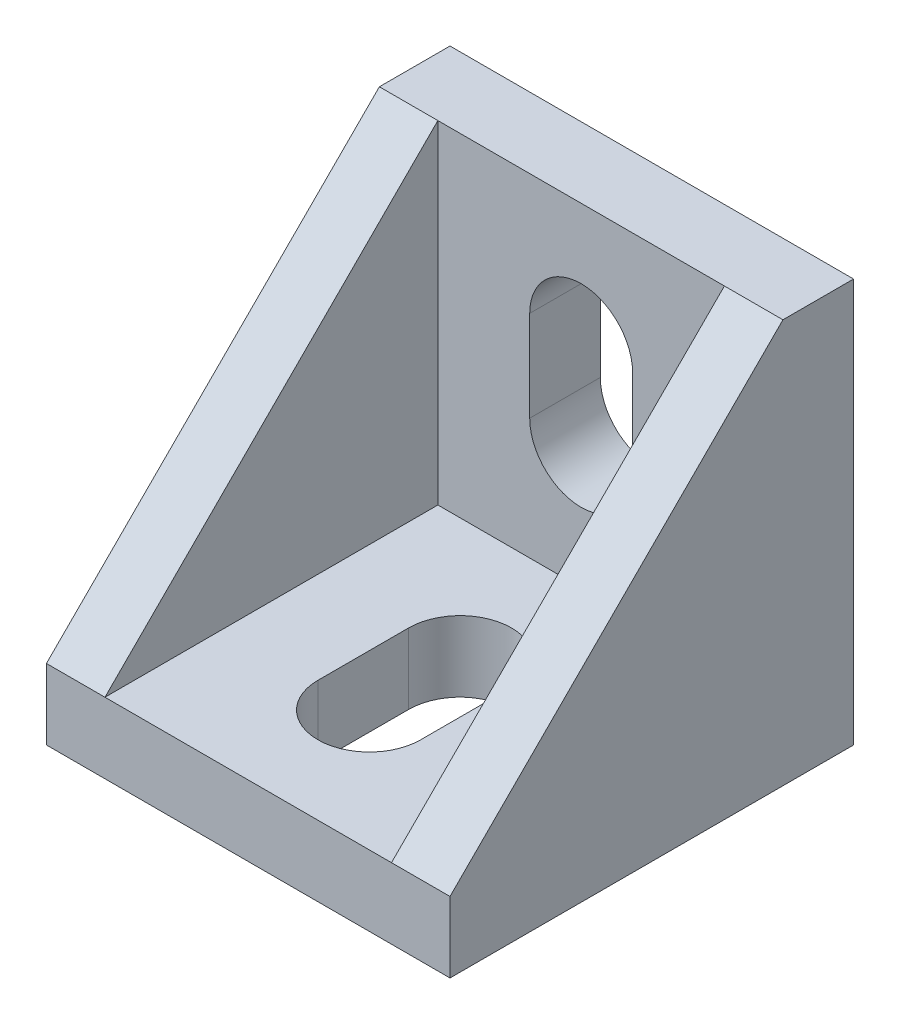
ISO-10303-21;
HEADER;
FILE_DESCRIPTION(('STEP AP214'),'2;1');
FILE_NAME('part.step','',(''),(''),'','','');
FILE_SCHEMA(('AUTOMOTIVE_DESIGN { 1 0 10303 214 1 1 1 1 }'));
ENDSEC;
DATA;
#1=APPLICATION_CONTEXT('core data for automotive mechanical design processes');
#2=APPLICATION_PROTOCOL_DEFINITION('international standard','automotive_design',2000,#1);
#3=PRODUCT_CONTEXT('',#1,'mechanical');
#4=PRODUCT('Part','Part','',(#3));
#5=PRODUCT_RELATED_PRODUCT_CATEGORY('part','',(#4));
#6=PRODUCT_DEFINITION_FORMATION('','',#4);
#7=PRODUCT_DEFINITION_CONTEXT('part definition',#1,'design');
#8=PRODUCT_DEFINITION('design','',#6,#7);
#9=PRODUCT_DEFINITION_SHAPE('','',#8);
#10=(LENGTH_UNIT() NAMED_UNIT(*) SI_UNIT(.MILLI.,.METRE.));
#11=(NAMED_UNIT(*) PLANE_ANGLE_UNIT() SI_UNIT($,.RADIAN.));
#12=(NAMED_UNIT(*) SI_UNIT($,.STERADIAN.) SOLID_ANGLE_UNIT());
#13=UNCERTAINTY_MEASURE_WITH_UNIT(LENGTH_MEASURE(1.E-05),#10,'distance_accuracy_value','');
#14=(GEOMETRIC_REPRESENTATION_CONTEXT(3) GLOBAL_UNCERTAINTY_ASSIGNED_CONTEXT((#13)) GLOBAL_UNIT_ASSIGNED_CONTEXT((#10,
#11,#12)) REPRESENTATION_CONTEXT('',''));
#15=CARTESIAN_POINT('',(0.,0.,0.));
#16=DIRECTION('',(0.,0.,1.));
#17=DIRECTION('',(1.,0.,0.));
#18=AXIS2_PLACEMENT_3D('',#15,#16,#17);
#19=CARTESIAN_POINT('',(0.,20.,3.5));
#20=DIRECTION('',(0.,0.,-1.));
#21=DIRECTION('',(-1.,0.,0.));
#22=AXIS2_PLACEMENT_3D('',#19,#20,#21);
#23=PLANE('',#22);
#24=DIRECTION('',(0.,-1.,0.));
#25=VECTOR('',#24,1.);
#26=CARTESIAN_POINT('',(7.45,9.5,3.5));
#27=LINE('',#26,#25);
#28=CARTESIAN_POINT('',(7.45,14.,3.5));
#29=VERTEX_POINT('',#28);
#30=CARTESIAN_POINT('',(7.45,9.5,3.5));
#31=VERTEX_POINT('',#30);
#32=EDGE_CURVE('E166',#29,#31,#27,.T.);
#33=ORIENTED_EDGE('',*,*,#32,.F.);
#34=CARTESIAN_POINT('',(10.,14.,3.5));
#35=DIRECTION('',(0.,0.,1.));
#36=DIRECTION('',(1.,0.,0.));
#37=AXIS2_PLACEMENT_3D('',#34,#35,#36);
#38=CIRCLE('',#37,2.55);
#39=CARTESIAN_POINT('',(12.55,14.,3.5));
#40=VERTEX_POINT('',#39);
#41=EDGE_CURVE('E49',#40,#29,#38,.T.);
#42=ORIENTED_EDGE('',*,*,#41,.F.);
#43=DIRECTION('',(0.,1.,0.));
#44=VECTOR('',#43,1.);
#45=CARTESIAN_POINT('',(12.55,14.,3.5));
#46=LINE('',#45,#44);
#47=CARTESIAN_POINT('',(12.55,9.5,3.5));
#48=VERTEX_POINT('',#47);
#49=EDGE_CURVE('E159',#48,#40,#46,.T.);
#50=ORIENTED_EDGE('',*,*,#49,.F.);
#51=CARTESIAN_POINT('',(10.,9.5,3.5));
#52=DIRECTION('',(0.,0.,1.));
#53=DIRECTION('',(-1.,0.,0.));
#54=AXIS2_PLACEMENT_3D('',#51,#52,#53);
#55=CIRCLE('',#54,2.55);
#56=EDGE_CURVE('E173',#31,#48,#55,.T.);
#57=ORIENTED_EDGE('',*,*,#56,.F.);
#58=EDGE_LOOP('',(#33,#42,#50,#57));
#59=FACE_BOUND('',#58,.T.);
#60=DIRECTION('',(0.,-1.,0.));
#61=VECTOR('',#60,1.);
#62=CARTESIAN_POINT('',(2.9,3.5,3.5));
#63=LINE('',#62,#61);
#64=CARTESIAN_POINT('',(2.9,20.,3.5));
#65=VERTEX_POINT('',#64);
#66=CARTESIAN_POINT('',(2.9,3.5,3.5));
#67=VERTEX_POINT('',#66);
#68=EDGE_CURVE('E213',#65,#67,#63,.T.);
#69=ORIENTED_EDGE('',*,*,#68,.T.);
#70=DIRECTION('',(-1.,0.,0.));
#71=VECTOR('',#70,1.);
#72=CARTESIAN_POINT('',(0.,3.5,3.5));
#73=LINE('',#72,#71);
#74=CARTESIAN_POINT('',(17.1,3.5,3.5));
#75=VERTEX_POINT('',#74);
#76=EDGE_CURVE('E36',#75,#67,#73,.T.);
#77=ORIENTED_EDGE('',*,*,#76,.F.);
#78=DIRECTION('',(0.,1.,0.));
#79=VECTOR('',#78,1.);
#80=CARTESIAN_POINT('',(17.1,3.5,3.5));
#81=LINE('',#80,#79);
#82=CARTESIAN_POINT('',(17.1,20.,3.5));
#83=VERTEX_POINT('',#82);
#84=EDGE_CURVE('E230',#75,#83,#81,.T.);
#85=ORIENTED_EDGE('',*,*,#84,.T.);
#86=DIRECTION('',(-1.,0.,0.));
#87=VECTOR('',#86,1.);
#88=CARTESIAN_POINT('',(0.,20.,3.5));
#89=LINE('',#88,#87);
#90=EDGE_CURVE('E259',#83,#65,#89,.T.);
#91=ORIENTED_EDGE('',*,*,#90,.T.);
#92=EDGE_LOOP('',(#69,#77,#85,#91));
#93=FACE_BOUND('',#92,.T.);
#94=ADVANCED_FACE('F32',(#59,#93),#23,.F.);
#95=CARTESIAN_POINT('',(0.,3.5,20.));
#96=DIRECTION('',(0.,-1.,0.));
#97=DIRECTION('',(0.,0.,-1.));
#98=AXIS2_PLACEMENT_3D('',#95,#96,#97);
#99=PLANE('',#98);
#100=DIRECTION('',(0.,0.,-1.));
#101=VECTOR('',#100,1.);
#102=CARTESIAN_POINT('',(12.55,3.5,9.5));
#103=LINE('',#102,#101);
#104=CARTESIAN_POINT('',(12.55,3.5,14.));
#105=VERTEX_POINT('',#104);
#106=CARTESIAN_POINT('',(12.55,3.5,9.5));
#107=VERTEX_POINT('',#106);
#108=EDGE_CURVE('E191',#105,#107,#103,.T.);
#109=ORIENTED_EDGE('',*,*,#108,.F.);
#110=CARTESIAN_POINT('',(10.,3.5,14.));
#111=DIRECTION('',(0.,1.,0.));
#112=DIRECTION('',(0.,0.,1.));
#113=AXIS2_PLACEMENT_3D('',#110,#111,#112);
#114=CIRCLE('',#113,2.55);
#115=CARTESIAN_POINT('',(7.45,3.5,14.));
#116=VERTEX_POINT('',#115);
#117=EDGE_CURVE('E189',#116,#105,#114,.T.);
#118=ORIENTED_EDGE('',*,*,#117,.F.);
#119=DIRECTION('',(0.,0.,1.));
#120=VECTOR('',#119,1.);
#121=CARTESIAN_POINT('',(7.45,3.5,14.));
#122=LINE('',#121,#120);
#123=CARTESIAN_POINT('',(7.45,3.5,9.5));
#124=VERTEX_POINT('',#123);
#125=EDGE_CURVE('E197',#124,#116,#122,.T.);
#126=ORIENTED_EDGE('',*,*,#125,.F.);
#127=CARTESIAN_POINT('',(10.,3.5,9.5));
#128=DIRECTION('',(0.,1.,0.));
#129=DIRECTION('',(0.,0.,-1.));
#130=AXIS2_PLACEMENT_3D('',#127,#128,#129);
#131=CIRCLE('',#130,2.55);
#132=EDGE_CURVE('E194',#107,#124,#131,.T.);
#133=ORIENTED_EDGE('',*,*,#132,.F.);
#134=EDGE_LOOP('',(#109,#118,#126,#133));
#135=FACE_BOUND('',#134,.T.);
#136=DIRECTION('',(0.,0.,1.));
#137=VECTOR('',#136,1.);
#138=CARTESIAN_POINT('',(2.9,3.5,20.));
#139=LINE('',#138,#137);
#140=CARTESIAN_POINT('',(2.9,3.5,20.));
#141=VERTEX_POINT('',#140);
#142=EDGE_CURVE('E216',#67,#141,#139,.T.);
#143=ORIENTED_EDGE('',*,*,#142,.T.);
#144=DIRECTION('',(-1.,0.,0.));
#145=VECTOR('',#144,1.);
#146=CARTESIAN_POINT('',(0.,3.5,20.));
#147=LINE('',#146,#145);
#148=CARTESIAN_POINT('',(17.1,3.5,20.));
#149=VERTEX_POINT('',#148);
#150=EDGE_CURVE('E250',#149,#141,#147,.T.);
#151=ORIENTED_EDGE('',*,*,#150,.F.);
#152=DIRECTION('',(0.,0.,-1.));
#153=VECTOR('',#152,1.);
#154=CARTESIAN_POINT('',(17.1,3.5,20.));
#155=LINE('',#154,#153);
#156=EDGE_CURVE('E236',#149,#75,#155,.T.);
#157=ORIENTED_EDGE('',*,*,#156,.T.);
#158=ORIENTED_EDGE('',*,*,#76,.T.);
#159=EDGE_LOOP('',(#143,#151,#157,#158));
#160=FACE_BOUND('',#159,.T.);
#161=ADVANCED_FACE('F298',(#135,#160),#99,.F.);
#162=CARTESIAN_POINT('',(0.,0.,3.5));
#163=DIRECTION('',(1.,0.,0.));
#164=DIRECTION('',(0.,0.,-1.));
#165=AXIS2_PLACEMENT_3D('',#162,#163,#164);
#166=PLANE('',#165);
#167=DIRECTION('',(0.,-1.,0.));
#168=VECTOR('',#167,1.);
#169=CARTESIAN_POINT('',(0.,0.,0.));
#170=LINE('',#169,#168);
#171=CARTESIAN_POINT('',(0.,20.,0.));
#172=VERTEX_POINT('',#171);
#173=CARTESIAN_POINT('',(0.,0.,0.));
#174=VERTEX_POINT('',#173);
#175=EDGE_CURVE('E253',#172,#174,#170,.T.);
#176=ORIENTED_EDGE('',*,*,#175,.T.);
#177=DIRECTION('',(0.,0.,-1.));
#178=VECTOR('',#177,1.);
#179=CARTESIAN_POINT('',(0.,0.,3.5));
#180=LINE('',#179,#178);
#181=CARTESIAN_POINT('',(0.,0.,20.));
#182=VERTEX_POINT('',#181);
#183=EDGE_CURVE('E11',#182,#174,#180,.T.);
#184=ORIENTED_EDGE('',*,*,#183,.F.);
#185=DIRECTION('',(0.,-1.,0.));
#186=VECTOR('',#185,1.);
#187=CARTESIAN_POINT('',(0.,0.,20.));
#188=LINE('',#187,#186);
#189=CARTESIAN_POINT('',(0.,3.5,20.));
#190=VERTEX_POINT('',#189);
#191=EDGE_CURVE('E241',#190,#182,#188,.T.);
#192=ORIENTED_EDGE('',*,*,#191,.F.);
#193=DIRECTION('',(0.,0.707106781186547,-0.707106781186547));
#194=VECTOR('',#193,1.);
#195=CARTESIAN_POINT('',(0.,20.,3.5));
#196=LINE('',#195,#194);
#197=CARTESIAN_POINT('',(0.,20.,3.5));
#198=VERTEX_POINT('',#197);
#199=EDGE_CURVE('E212',#190,#198,#196,.T.);
#200=ORIENTED_EDGE('',*,*,#199,.T.);
#201=DIRECTION('',(0.,0.,-1.));
#202=VECTOR('',#201,1.);
#203=CARTESIAN_POINT('',(0.,20.,3.5));
#204=LINE('',#203,#202);
#205=EDGE_CURVE('E258',#198,#172,#204,.T.);
#206=ORIENTED_EDGE('',*,*,#205,.T.);
#207=EDGE_LOOP('',(#176,#184,#192,#200,#206));
#208=FACE_BOUND('',#207,.T.);
#209=ADVANCED_FACE('F34',(#208),#166,.F.);
#210=CARTESIAN_POINT('',(0.,0.,3.5));
#211=DIRECTION('',(0.,1.,0.));
#212=DIRECTION('',(0.,0.,1.));
#213=AXIS2_PLACEMENT_3D('',#210,#211,#212);
#214=PLANE('',#213);
#215=DIRECTION('',(0.,0.,-1.));
#216=VECTOR('',#215,1.);
#217=CARTESIAN_POINT('',(7.45,0.,14.));
#218=LINE('',#217,#216);
#219=CARTESIAN_POINT('',(7.45,0.,14.));
#220=VERTEX_POINT('',#219);
#221=CARTESIAN_POINT('',(7.45,0.,9.5));
#222=VERTEX_POINT('',#221);
#223=EDGE_CURVE('E183',#220,#222,#218,.T.);
#224=ORIENTED_EDGE('',*,*,#223,.F.);
#225=CARTESIAN_POINT('',(10.,0.,14.));
#226=DIRECTION('',(0.,1.,0.));
#227=DIRECTION('',(0.,0.,1.));
#228=AXIS2_PLACEMENT_3D('',#225,#226,#227);
#229=CIRCLE('',#228,2.55);
#230=CARTESIAN_POINT('',(12.55,0.,14.));
#231=VERTEX_POINT('',#230);
#232=EDGE_CURVE('E186',#231,#220,#229,.F.);
#233=ORIENTED_EDGE('',*,*,#232,.F.);
#234=DIRECTION('',(0.,0.,1.));
#235=VECTOR('',#234,1.);
#236=CARTESIAN_POINT('',(12.55,0.,9.5));
#237=LINE('',#236,#235);
#238=CARTESIAN_POINT('',(12.55,0.,9.5));
#239=VERTEX_POINT('',#238);
#240=EDGE_CURVE('E203',#239,#231,#237,.T.);
#241=ORIENTED_EDGE('',*,*,#240,.F.);
#242=CARTESIAN_POINT('',(10.,0.,9.5));
#243=DIRECTION('',(0.,1.,0.));
#244=DIRECTION('',(0.,0.,1.));
#245=AXIS2_PLACEMENT_3D('',#242,#243,#244);
#246=CIRCLE('',#245,2.55);
#247=EDGE_CURVE('E153',#222,#239,#246,.F.);
#248=ORIENTED_EDGE('',*,*,#247,.F.);
#249=EDGE_LOOP('',(#224,#233,#241,#248));
#250=FACE_BOUND('',#249,.T.);
#251=DIRECTION('',(1.,0.,0.));
#252=VECTOR('',#251,1.);
#253=CARTESIAN_POINT('',(0.,0.,0.));
#254=LINE('',#253,#252);
#255=CARTESIAN_POINT('',(20.,0.,0.));
#256=VERTEX_POINT('',#255);
#257=EDGE_CURVE('E262',#174,#256,#254,.T.);
#258=ORIENTED_EDGE('',*,*,#257,.T.);
#259=DIRECTION('',(0.,0.,-1.));
#260=VECTOR('',#259,1.);
#261=CARTESIAN_POINT('',(20.,0.,3.5));
#262=LINE('',#261,#260);
#263=CARTESIAN_POINT('',(20.,0.,20.));
#264=VERTEX_POINT('',#263);
#265=EDGE_CURVE('E42',#264,#256,#262,.T.);
#266=ORIENTED_EDGE('',*,*,#265,.F.);
#267=DIRECTION('',(1.,0.,0.));
#268=VECTOR('',#267,1.);
#269=CARTESIAN_POINT('',(0.,0.,20.));
#270=LINE('',#269,#268);
#271=EDGE_CURVE('E244',#182,#264,#270,.T.);
#272=ORIENTED_EDGE('',*,*,#271,.F.);
#273=ORIENTED_EDGE('',*,*,#183,.T.);
#274=EDGE_LOOP('',(#258,#266,#272,#273));
#275=FACE_BOUND('',#274,.T.);
#276=ADVANCED_FACE('F334',(#250,#275),#214,.F.);
#277=CARTESIAN_POINT('',(20.,0.,3.5));
#278=DIRECTION('',(-1.,0.,0.));
#279=DIRECTION('',(0.,0.,1.));
#280=AXIS2_PLACEMENT_3D('',#277,#278,#279);
#281=PLANE('',#280);
#282=DIRECTION('',(0.,0.,-1.));
#283=VECTOR('',#282,1.);
#284=CARTESIAN_POINT('',(20.,20.,3.5));
#285=LINE('',#284,#283);
#286=CARTESIAN_POINT('',(20.,20.,3.5));
#287=VERTEX_POINT('',#286);
#288=CARTESIAN_POINT('',(20.,20.,0.));
#289=VERTEX_POINT('',#288);
#290=EDGE_CURVE('E270',#287,#289,#285,.T.);
#291=ORIENTED_EDGE('',*,*,#290,.F.);
#292=DIRECTION('',(0.,-0.707106781186547,0.707106781186547));
#293=VECTOR('',#292,1.);
#294=CARTESIAN_POINT('',(20.,20.,3.5));
#295=LINE('',#294,#293);
#296=CARTESIAN_POINT('',(20.,3.5,20.));
#297=VERTEX_POINT('',#296);
#298=EDGE_CURVE('E227',#287,#297,#295,.T.);
#299=ORIENTED_EDGE('',*,*,#298,.T.);
#300=DIRECTION('',(0.,1.,0.));
#301=VECTOR('',#300,1.);
#302=CARTESIAN_POINT('',(20.,0.,20.));
#303=LINE('',#302,#301);
#304=EDGE_CURVE('E247',#264,#297,#303,.T.);
#305=ORIENTED_EDGE('',*,*,#304,.F.);
#306=ORIENTED_EDGE('',*,*,#265,.T.);
#307=DIRECTION('',(0.,1.,0.));
#308=VECTOR('',#307,1.);
#309=CARTESIAN_POINT('',(20.,0.,0.));
#310=LINE('',#309,#308);
#311=EDGE_CURVE('E264',#256,#289,#310,.T.);
#312=ORIENTED_EDGE('',*,*,#311,.T.);
#313=EDGE_LOOP('',(#291,#299,#305,#306,#312));
#314=FACE_BOUND('',#313,.T.);
#315=ADVANCED_FACE('F278',(#314),#281,.F.);
#316=CARTESIAN_POINT('',(0.,20.,3.5));
#317=DIRECTION('',(0.,-1.,0.));
#318=DIRECTION('',(0.,0.,-1.));
#319=AXIS2_PLACEMENT_3D('',#316,#317,#318);
#320=PLANE('',#319);
#321=DIRECTION('',(-1.,0.,0.));
#322=VECTOR('',#321,1.);
#323=CARTESIAN_POINT('',(0.,20.,0.));
#324=LINE('',#323,#322);
#325=EDGE_CURVE('E266',#289,#172,#324,.T.);
#326=ORIENTED_EDGE('',*,*,#325,.T.);
#327=ORIENTED_EDGE('',*,*,#205,.F.);
#328=DIRECTION('',(-1.,0.,0.));
#329=VECTOR('',#328,1.);
#330=CARTESIAN_POINT('',(2.9,20.,3.5));
#331=LINE('',#330,#329);
#332=EDGE_CURVE('E225',#65,#198,#331,.T.);
#333=ORIENTED_EDGE('',*,*,#332,.F.);
#334=ORIENTED_EDGE('',*,*,#90,.F.);
#335=EDGE_CURVE('E256',#287,#83,#89,.T.);
#336=ORIENTED_EDGE('',*,*,#335,.F.);
#337=ORIENTED_EDGE('',*,*,#290,.T.);
#338=EDGE_LOOP('',(#326,#327,#333,#334,#336,#337));
#339=FACE_BOUND('',#338,.T.);
#340=ADVANCED_FACE('F285',(#339),#320,.F.);
#341=CARTESIAN_POINT('',(0.,20.,0.));
#342=DIRECTION('',(0.,0.,-1.));
#343=DIRECTION('',(-1.,0.,0.));
#344=AXIS2_PLACEMENT_3D('',#341,#342,#343);
#345=PLANE('',#344);
#346=CARTESIAN_POINT('',(10.,14.,0.));
#347=DIRECTION('',(0.,0.,-1.));
#348=DIRECTION('',(-1.,0.,0.));
#349=AXIS2_PLACEMENT_3D('',#346,#347,#348);
#350=CIRCLE('',#349,2.55);
#351=CARTESIAN_POINT('',(12.55,14.,0.));
#352=VERTEX_POINT('',#351);
#353=CARTESIAN_POINT('',(7.45,14.,0.));
#354=VERTEX_POINT('',#353);
#355=EDGE_CURVE('E157',#352,#354,#350,.F.);
#356=ORIENTED_EDGE('',*,*,#355,.T.);
#357=DIRECTION('',(0.,-1.,0.));
#358=VECTOR('',#357,1.);
#359=CARTESIAN_POINT('',(7.45,9.5,0.));
#360=LINE('',#359,#358);
#361=CARTESIAN_POINT('',(7.45,9.5,0.));
#362=VERTEX_POINT('',#361);
#363=EDGE_CURVE('E146',#354,#362,#360,.T.);
#364=ORIENTED_EDGE('',*,*,#363,.T.);
#365=CARTESIAN_POINT('',(10.,9.5,0.));
#366=DIRECTION('',(0.,0.,-1.));
#367=DIRECTION('',(-1.,0.,0.));
#368=AXIS2_PLACEMENT_3D('',#365,#366,#367);
#369=CIRCLE('',#368,2.55);
#370=CARTESIAN_POINT('',(12.55,9.5,0.));
#371=VERTEX_POINT('',#370);
#372=EDGE_CURVE('E168',#362,#371,#369,.F.);
#373=ORIENTED_EDGE('',*,*,#372,.T.);
#374=DIRECTION('',(0.,1.,0.));
#375=VECTOR('',#374,1.);
#376=CARTESIAN_POINT('',(12.55,14.,0.));
#377=LINE('',#376,#375);
#378=EDGE_CURVE('E164',#371,#352,#377,.T.);
#379=ORIENTED_EDGE('',*,*,#378,.T.);
#380=EDGE_LOOP('',(#356,#364,#373,#379));
#381=FACE_BOUND('',#380,.T.);
#382=ORIENTED_EDGE('',*,*,#175,.F.);
#383=ORIENTED_EDGE('',*,*,#325,.F.);
#384=ORIENTED_EDGE('',*,*,#311,.F.);
#385=ORIENTED_EDGE('',*,*,#257,.F.);
#386=EDGE_LOOP('',(#382,#383,#384,#385));
#387=FACE_BOUND('',#386,.T.);
#388=ADVANCED_FACE('F162',(#381,#387),#345,.T.);
#389=CARTESIAN_POINT('',(0.,3.5,20.));
#390=DIRECTION('',(0.,0.,-1.));
#391=DIRECTION('',(-1.,0.,0.));
#392=AXIS2_PLACEMENT_3D('',#389,#390,#391);
#393=PLANE('',#392);
#394=ORIENTED_EDGE('',*,*,#191,.T.);
#395=ORIENTED_EDGE('',*,*,#271,.T.);
#396=ORIENTED_EDGE('',*,*,#304,.T.);
#397=EDGE_CURVE('E251',#297,#149,#147,.T.);
#398=ORIENTED_EDGE('',*,*,#397,.T.);
#399=ORIENTED_EDGE('',*,*,#150,.T.);
#400=DIRECTION('',(-1.,0.,0.));
#401=VECTOR('',#400,1.);
#402=CARTESIAN_POINT('',(2.9,3.5,20.));
#403=LINE('',#402,#401);
#404=EDGE_CURVE('E222',#141,#190,#403,.T.);
#405=ORIENTED_EDGE('',*,*,#404,.T.);
#406=EDGE_LOOP('',(#394,#395,#396,#398,#399,#405));
#407=FACE_BOUND('',#406,.T.);
#408=ADVANCED_FACE('F295',(#407),#393,.F.);
#409=CARTESIAN_POINT('',(17.1,20.,3.5));
#410=DIRECTION('',(0.,0.707106781186548,0.707106781186548));
#411=DIRECTION('',(0.,-0.707106781186548,0.707106781186548));
#412=AXIS2_PLACEMENT_3D('',#409,#410,#411);
#413=PLANE('',#412);
#414=ORIENTED_EDGE('',*,*,#298,.F.);
#415=ORIENTED_EDGE('',*,*,#335,.T.);
#416=DIRECTION('',(0.,-0.707106781186547,0.707106781186547));
#417=VECTOR('',#416,1.);
#418=CARTESIAN_POINT('',(17.1,20.,3.5));
#419=LINE('',#418,#417);
#420=EDGE_CURVE('E233',#83,#149,#419,.T.);
#421=ORIENTED_EDGE('',*,*,#420,.T.);
#422=ORIENTED_EDGE('',*,*,#397,.F.);
#423=EDGE_LOOP('',(#414,#415,#421,#422));
#424=FACE_BOUND('',#423,.T.);
#425=ADVANCED_FACE('F308',(#424),#413,.T.);
#426=CARTESIAN_POINT('',(17.1,3.5,3.5));
#427=DIRECTION('',(-1.,0.,0.));
#428=DIRECTION('',(0.,0.,1.));
#429=AXIS2_PLACEMENT_3D('',#426,#427,#428);
#430=PLANE('',#429);
#431=ORIENTED_EDGE('',*,*,#84,.F.);
#432=ORIENTED_EDGE('',*,*,#156,.F.);
#433=ORIENTED_EDGE('',*,*,#420,.F.);
#434=EDGE_LOOP('',(#431,#432,#433));
#435=FACE_BOUND('',#434,.T.);
#436=ADVANCED_FACE('F310',(#435),#430,.T.);
#437=CARTESIAN_POINT('',(2.9,20.,3.5));
#438=DIRECTION('',(0.,0.707106781186548,0.707106781186548));
#439=DIRECTION('',(0.,-0.707106781186548,0.707106781186548));
#440=AXIS2_PLACEMENT_3D('',#437,#438,#439);
#441=PLANE('',#440);
#442=ORIENTED_EDGE('',*,*,#199,.F.);
#443=ORIENTED_EDGE('',*,*,#404,.F.);
#444=DIRECTION('',(0.,0.707106781186547,-0.707106781186547));
#445=VECTOR('',#444,1.);
#446=CARTESIAN_POINT('',(2.9,20.,3.5));
#447=LINE('',#446,#445);
#448=EDGE_CURVE('E219',#141,#65,#447,.T.);
#449=ORIENTED_EDGE('',*,*,#448,.T.);
#450=ORIENTED_EDGE('',*,*,#332,.T.);
#451=EDGE_LOOP('',(#442,#443,#449,#450));
#452=FACE_BOUND('',#451,.T.);
#453=ADVANCED_FACE('F291',(#452),#441,.T.);
#454=CARTESIAN_POINT('',(2.9,3.5,3.5));
#455=DIRECTION('',(-1.,0.,0.));
#456=DIRECTION('',(0.,0.,1.));
#457=AXIS2_PLACEMENT_3D('',#454,#455,#456);
#458=PLANE('',#457);
#459=ORIENTED_EDGE('',*,*,#68,.F.);
#460=ORIENTED_EDGE('',*,*,#448,.F.);
#461=ORIENTED_EDGE('',*,*,#142,.F.);
#462=EDGE_LOOP('',(#459,#460,#461));
#463=FACE_BOUND('',#462,.T.);
#464=ADVANCED_FACE('F302',(#463),#458,.F.);
#465=CARTESIAN_POINT('',(10.,-0.00100000000000013,14.));
#466=DIRECTION('',(0.,1.,0.));
#467=DIRECTION('',(0.,0.,1.));
#468=AXIS2_PLACEMENT_3D('',#465,#466,#467);
#469=CYLINDRICAL_SURFACE('',#468,2.55);
#470=ORIENTED_EDGE('',*,*,#232,.T.);
#471=DIRECTION('',(0.,1.,0.));
#472=VECTOR('',#471,1.);
#473=CARTESIAN_POINT('',(7.45,-0.00100000000000013,14.));
#474=LINE('',#473,#472);
#475=EDGE_CURVE('E201',#220,#116,#474,.T.);
#476=ORIENTED_EDGE('',*,*,#475,.T.);
#477=ORIENTED_EDGE('',*,*,#117,.T.);
#478=DIRECTION('',(0.,1.,0.));
#479=VECTOR('',#478,1.);
#480=CARTESIAN_POINT('',(12.55,-0.00100000000000013,14.));
#481=LINE('',#480,#479);
#482=EDGE_CURVE('E200',#231,#105,#481,.T.);
#483=ORIENTED_EDGE('',*,*,#482,.F.);
#484=EDGE_LOOP('',(#470,#476,#477,#483));
#485=FACE_BOUND('',#484,.T.);
#486=ADVANCED_FACE('F349',(#485),#469,.F.);
#487=CARTESIAN_POINT('',(7.45,-0.00100000000000013,14.));
#488=DIRECTION('',(-1.,0.,0.));
#489=DIRECTION('',(0.,0.,1.));
#490=AXIS2_PLACEMENT_3D('',#487,#488,#489);
#491=PLANE('',#490);
#492=ORIENTED_EDGE('',*,*,#223,.T.);
#493=DIRECTION('',(0.,1.,0.));
#494=VECTOR('',#493,1.);
#495=CARTESIAN_POINT('',(7.45,-0.00100000000000013,9.5));
#496=LINE('',#495,#494);
#497=EDGE_CURVE('E204',#222,#124,#496,.T.);
#498=ORIENTED_EDGE('',*,*,#497,.T.);
#499=ORIENTED_EDGE('',*,*,#125,.T.);
#500=ORIENTED_EDGE('',*,*,#475,.F.);
#501=EDGE_LOOP('',(#492,#498,#499,#500));
#502=FACE_BOUND('',#501,.T.);
#503=ADVANCED_FACE('F345',(#502),#491,.F.);
#504=CARTESIAN_POINT('',(10.,-0.00100000000000013,9.5));
#505=DIRECTION('',(0.,1.,0.));
#506=DIRECTION('',(0.,0.,1.));
#507=AXIS2_PLACEMENT_3D('',#504,#505,#506);
#508=CYLINDRICAL_SURFACE('',#507,2.55);
#509=ORIENTED_EDGE('',*,*,#247,.T.);
#510=DIRECTION('',(0.,1.,0.));
#511=VECTOR('',#510,1.);
#512=CARTESIAN_POINT('',(12.55,-0.00100000000000013,9.5));
#513=LINE('',#512,#511);
#514=EDGE_CURVE('E206',#239,#107,#513,.T.);
#515=ORIENTED_EDGE('',*,*,#514,.T.);
#516=ORIENTED_EDGE('',*,*,#132,.T.);
#517=ORIENTED_EDGE('',*,*,#497,.F.);
#518=EDGE_LOOP('',(#509,#515,#516,#517));
#519=FACE_BOUND('',#518,.T.);
#520=ADVANCED_FACE('F356',(#519),#508,.F.);
#521=CARTESIAN_POINT('',(12.55,-0.00100000000000013,9.5));
#522=DIRECTION('',(1.,0.,0.));
#523=DIRECTION('',(0.,0.,-1.));
#524=AXIS2_PLACEMENT_3D('',#521,#522,#523);
#525=PLANE('',#524);
#526=ORIENTED_EDGE('',*,*,#240,.T.);
#527=ORIENTED_EDGE('',*,*,#482,.T.);
#528=ORIENTED_EDGE('',*,*,#108,.T.);
#529=ORIENTED_EDGE('',*,*,#514,.F.);
#530=EDGE_LOOP('',(#526,#527,#528,#529));
#531=FACE_BOUND('',#530,.T.);
#532=ADVANCED_FACE('F353',(#531),#525,.F.);
#533=CARTESIAN_POINT('',(10.,14.,-0.00100000000000013));
#534=DIRECTION('',(0.,0.,1.));
#535=DIRECTION('',(1.,0.,0.));
#536=AXIS2_PLACEMENT_3D('',#533,#534,#535);
#537=CYLINDRICAL_SURFACE('',#536,2.55);
#538=DIRECTION('',(0.,0.,1.));
#539=VECTOR('',#538,1.);
#540=CARTESIAN_POINT('',(12.55,14.,-0.00100000000000013));
#541=LINE('',#540,#539);
#542=EDGE_CURVE('E154',#352,#40,#541,.T.);
#543=ORIENTED_EDGE('',*,*,#542,.T.);
#544=ORIENTED_EDGE('',*,*,#41,.T.);
#545=DIRECTION('',(0.,0.,1.));
#546=VECTOR('',#545,1.);
#547=CARTESIAN_POINT('',(7.45,14.,-0.00100000000000013));
#548=LINE('',#547,#546);
#549=EDGE_CURVE('E148',#354,#29,#548,.T.);
#550=ORIENTED_EDGE('',*,*,#549,.F.);
#551=ORIENTED_EDGE('',*,*,#355,.F.);
#552=EDGE_LOOP('',(#543,#544,#550,#551));
#553=FACE_BOUND('',#552,.T.);
#554=ADVANCED_FACE('F156',(#553),#537,.F.);
#555=CARTESIAN_POINT('',(12.55,14.,-0.00100000000000013));
#556=DIRECTION('',(1.,0.,0.));
#557=DIRECTION('',(0.,0.,-1.));
#558=AXIS2_PLACEMENT_3D('',#555,#556,#557);
#559=PLANE('',#558);
#560=DIRECTION('',(0.,0.,1.));
#561=VECTOR('',#560,1.);
#562=CARTESIAN_POINT('',(12.55,9.5,-0.00100000000000013));
#563=LINE('',#562,#561);
#564=EDGE_CURVE('E179',#371,#48,#563,.T.);
#565=ORIENTED_EDGE('',*,*,#564,.T.);
#566=ORIENTED_EDGE('',*,*,#49,.T.);
#567=ORIENTED_EDGE('',*,*,#542,.F.);
#568=ORIENTED_EDGE('',*,*,#378,.F.);
#569=EDGE_LOOP('',(#565,#566,#567,#568));
#570=FACE_BOUND('',#569,.T.);
#571=ADVANCED_FACE('F417',(#570),#559,.F.);
#572=CARTESIAN_POINT('',(10.,9.5,-0.00100000000000013));
#573=DIRECTION('',(0.,0.,1.));
#574=DIRECTION('',(1.,0.,0.));
#575=AXIS2_PLACEMENT_3D('',#572,#573,#574);
#576=CYLINDRICAL_SURFACE('',#575,2.55);
#577=DIRECTION('',(0.,0.,1.));
#578=VECTOR('',#577,1.);
#579=CARTESIAN_POINT('',(7.45,9.5,-0.00100000000000013));
#580=LINE('',#579,#578);
#581=EDGE_CURVE('E57',#362,#31,#580,.T.);
#582=ORIENTED_EDGE('',*,*,#581,.T.);
#583=ORIENTED_EDGE('',*,*,#56,.T.);
#584=ORIENTED_EDGE('',*,*,#564,.F.);
#585=ORIENTED_EDGE('',*,*,#372,.F.);
#586=EDGE_LOOP('',(#582,#583,#584,#585));
#587=FACE_BOUND('',#586,.T.);
#588=ADVANCED_FACE('F425',(#587),#576,.F.);
#589=CARTESIAN_POINT('',(7.45,9.5,-0.00100000000000013));
#590=DIRECTION('',(-1.,0.,0.));
#591=DIRECTION('',(0.,0.,1.));
#592=AXIS2_PLACEMENT_3D('',#589,#590,#591);
#593=PLANE('',#592);
#594=ORIENTED_EDGE('',*,*,#549,.T.);
#595=ORIENTED_EDGE('',*,*,#32,.T.);
#596=ORIENTED_EDGE('',*,*,#581,.F.);
#597=ORIENTED_EDGE('',*,*,#363,.F.);
#598=EDGE_LOOP('',(#594,#595,#596,#597));
#599=FACE_BOUND('',#598,.T.);
#600=ADVANCED_FACE('F147',(#599),#593,.F.);
#601=CLOSED_SHELL('',(#94,#161,#209,#276,#315,#340,#388,#408,#425,#436,#453,#464,#486,#503,#520,
#532,#554,#571,#588,#600));
#602=MANIFOLD_SOLID_BREP('B2',#601);
#603=ADVANCED_BREP_SHAPE_REPRESENTATION('',(#18,#602),#14);
#604=SHAPE_DEFINITION_REPRESENTATION(#9,#603);
ENDSEC;
END-ISO-10303-21;
